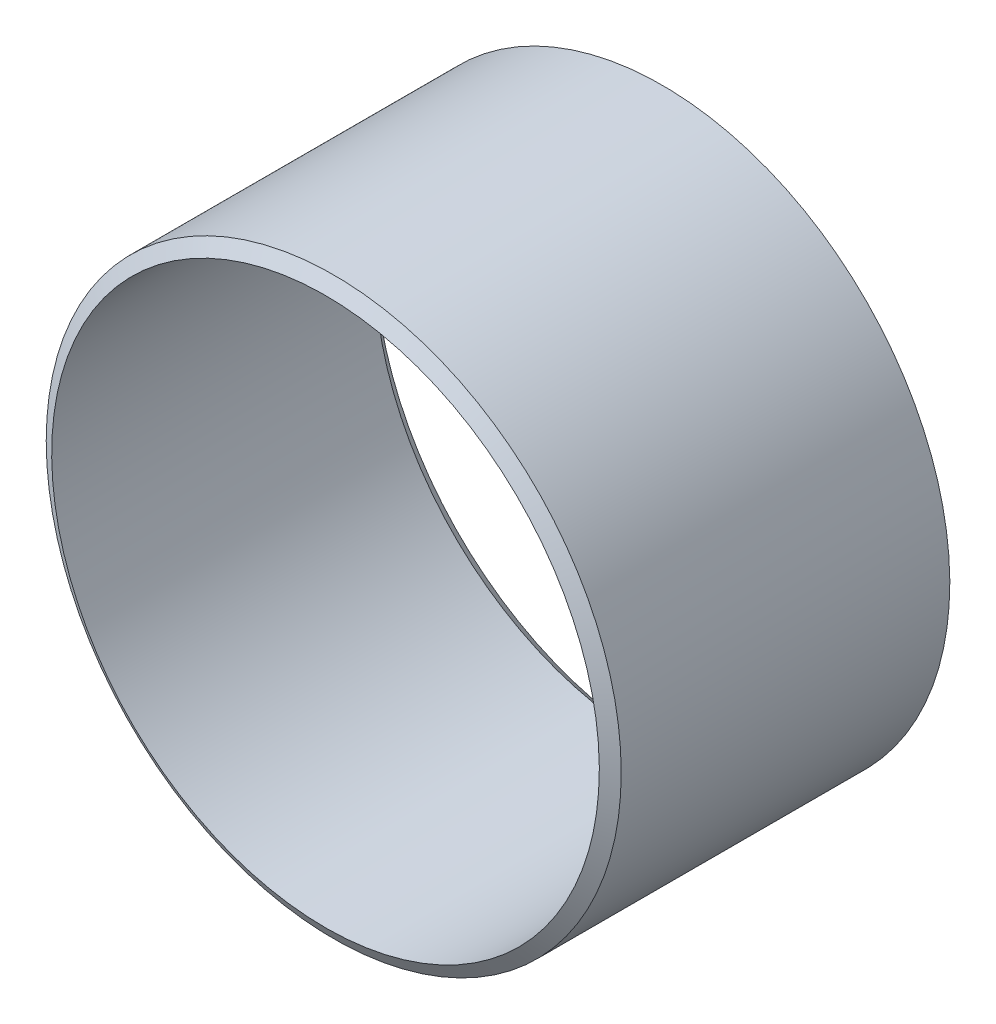
ISO-10303-21;
HEADER;
FILE_DESCRIPTION(('STEP AP214'),'2;1');
FILE_NAME('part.step','',(''),(''),'','','');
FILE_SCHEMA(('AUTOMOTIVE_DESIGN { 1 0 10303 214 1 1 1 1 }'));
ENDSEC;
DATA;
#1=APPLICATION_CONTEXT('core data for automotive mechanical design processes');
#2=APPLICATION_PROTOCOL_DEFINITION('international standard','automotive_design',2000,#1);
#3=PRODUCT_CONTEXT('',#1,'mechanical');
#4=PRODUCT('Part','Part','',(#3));
#5=PRODUCT_RELATED_PRODUCT_CATEGORY('part','',(#4));
#6=PRODUCT_DEFINITION_FORMATION('','',#4);
#7=PRODUCT_DEFINITION_CONTEXT('part definition',#1,'design');
#8=PRODUCT_DEFINITION('design','',#6,#7);
#9=PRODUCT_DEFINITION_SHAPE('','',#8);
#10=(LENGTH_UNIT() NAMED_UNIT(*) SI_UNIT(.MILLI.,.METRE.));
#11=(NAMED_UNIT(*) PLANE_ANGLE_UNIT() SI_UNIT($,.RADIAN.));
#12=(NAMED_UNIT(*) SI_UNIT($,.STERADIAN.) SOLID_ANGLE_UNIT());
#13=UNCERTAINTY_MEASURE_WITH_UNIT(LENGTH_MEASURE(1.E-05),#10,'distance_accuracy_value','');
#14=(GEOMETRIC_REPRESENTATION_CONTEXT(3) GLOBAL_UNCERTAINTY_ASSIGNED_CONTEXT((#13)) GLOBAL_UNIT_ASSIGNED_CONTEXT((#10,
#11,#12)) REPRESENTATION_CONTEXT('',''));
#15=CARTESIAN_POINT('',(0.,0.,0.));
#16=DIRECTION('',(0.,0.,1.));
#17=DIRECTION('',(1.,0.,0.));
#18=AXIS2_PLACEMENT_3D('',#15,#16,#17);
#19=CARTESIAN_POINT('',(-19.75,0.,41.7036993663488));
#20=DIRECTION('',(0.,0.,1.));
#21=DIRECTION('',(0.999907127685789,0.013628499666344,0.));
#22=AXIS2_PLACEMENT_3D('',#19,#20,#21);
#23=CYLINDRICAL_SURFACE('',#22,2.);
#24=CARTESIAN_POINT('',(-19.75,0.,40.4137854282515));
#25=DIRECTION('',(0.,0.,1.));
#26=DIRECTION('',(0.999907127685789,0.013628499666344,0.));
#27=AXIS2_PLACEMENT_3D('',#24,#25,#26);
#28=CIRCLE('',#27,2.);
#29=CARTESIAN_POINT('',(-21.7498142553716,-0.027256999332691,40.4137854282515));
#30=VERTEX_POINT('',#29);
#31=EDGE_CURVE('E25',#30,#30,#28,.T.);
#32=ORIENTED_EDGE('',*,*,#31,.T.);
#33=EDGE_LOOP('',(#32));
#34=FACE_BOUND('',#33,.T.);
#35=CARTESIAN_POINT('',(-19.75,0.,38.0536993663488));
#36=DIRECTION('',(0.,0.,1.));
#37=DIRECTION('',(0.999907127685789,0.013628499666344,0.));
#38=AXIS2_PLACEMENT_3D('',#35,#36,#37);
#39=CIRCLE('',#38,2.);
#40=CARTESIAN_POINT('',(-17.7501857446284,0.027256999332684,38.0536993663488));
#41=VERTEX_POINT('',#40);
#42=EDGE_CURVE('E11',#41,#41,#39,.T.);
#43=ORIENTED_EDGE('',*,*,#42,.F.);
#44=EDGE_LOOP('',(#43));
#45=FACE_BOUND('',#44,.T.);
#46=ADVANCED_FACE('F16',(#34,#45),#23,.F.);
#47=CARTESIAN_POINT('',(-19.75,0.,37.0536993663488));
#48=DIRECTION('',(0.,0.,-1.));
#49=DIRECTION('',(0.999907127685789,0.013628499666344,0.));
#50=AXIS2_PLACEMENT_3D('',#47,#48,#49);
#51=CONICAL_SURFACE('',#50,3.,0.7853981625);
#52=CARTESIAN_POINT('',(-19.75,0.,37.9536993663488));
#53=DIRECTION('',(0.,0.,-1.));
#54=DIRECTION('',(1.,0.,0.));
#55=AXIS2_PLACEMENT_3D('',#52,#53,#54);
#56=CIRCLE('',#55,2.1);
#57=CARTESIAN_POINT('',(-21.85,0.,37.9536993663488));
#58=VERTEX_POINT('',#57);
#59=EDGE_CURVE('E45',#58,#58,#56,.T.);
#60=ORIENTED_EDGE('',*,*,#59,.T.);
#61=EDGE_LOOP('',(#60));
#62=FACE_BOUND('',#61,.T.);
#63=ORIENTED_EDGE('',*,*,#42,.T.);
#64=EDGE_LOOP('',(#63));
#65=FACE_BOUND('',#64,.T.);
#66=ADVANCED_FACE('F46',(#62,#65),#51,.F.);
#67=CARTESIAN_POINT('',(-19.75,0.,40.9846030163278));
#68=DIRECTION('',(0.,0.,-1.));
#69=DIRECTION('',(1.,0.,0.));
#70=AXIS2_PLACEMENT_3D('',#67,#68,#69);
#71=CONICAL_SURFACE('',#70,1.05,1.0297442575);
#72=CARTESIAN_POINT('',(-19.75,0.,40.3536993663488));
#73=DIRECTION('',(0.,0.,-1.));
#74=DIRECTION('',(1.,0.,0.));
#75=AXIS2_PLACEMENT_3D('',#72,#73,#74);
#76=CIRCLE('',#75,2.1);
#77=CARTESIAN_POINT('',(-17.65,0.,40.3536993663488));
#78=VERTEX_POINT('',#77);
#79=EDGE_CURVE('E49',#78,#78,#76,.T.);
#80=ORIENTED_EDGE('',*,*,#79,.F.);
#81=EDGE_LOOP('',(#80));
#82=FACE_BOUND('',#81,.T.);
#83=ORIENTED_EDGE('',*,*,#31,.F.);
#84=EDGE_LOOP('',(#83));
#85=FACE_BOUND('',#84,.T.);
#86=ADVANCED_FACE('F60',(#82,#85),#71,.T.);
#87=CARTESIAN_POINT('',(-19.75,0.,37.8536993663488));
#88=DIRECTION('',(0.,0.,-1.));
#89=DIRECTION('',(1.,0.,0.));
#90=AXIS2_PLACEMENT_3D('',#87,#88,#89);
#91=CYLINDRICAL_SURFACE('',#90,2.1);
#92=ORIENTED_EDGE('',*,*,#79,.T.);
#93=EDGE_LOOP('',(#92));
#94=FACE_BOUND('',#93,.T.);
#95=ORIENTED_EDGE('',*,*,#59,.F.);
#96=EDGE_LOOP('',(#95));
#97=FACE_BOUND('',#96,.T.);
#98=ADVANCED_FACE('F62',(#94,#97),#91,.T.);
#99=CLOSED_SHELL('',(#46,#66,#86,#98));
#100=MANIFOLD_SOLID_BREP('B1',#99);
#101=ADVANCED_BREP_SHAPE_REPRESENTATION('',(#18,#100),#14);
#102=SHAPE_DEFINITION_REPRESENTATION(#9,#101);
ENDSEC;
END-ISO-10303-21;
